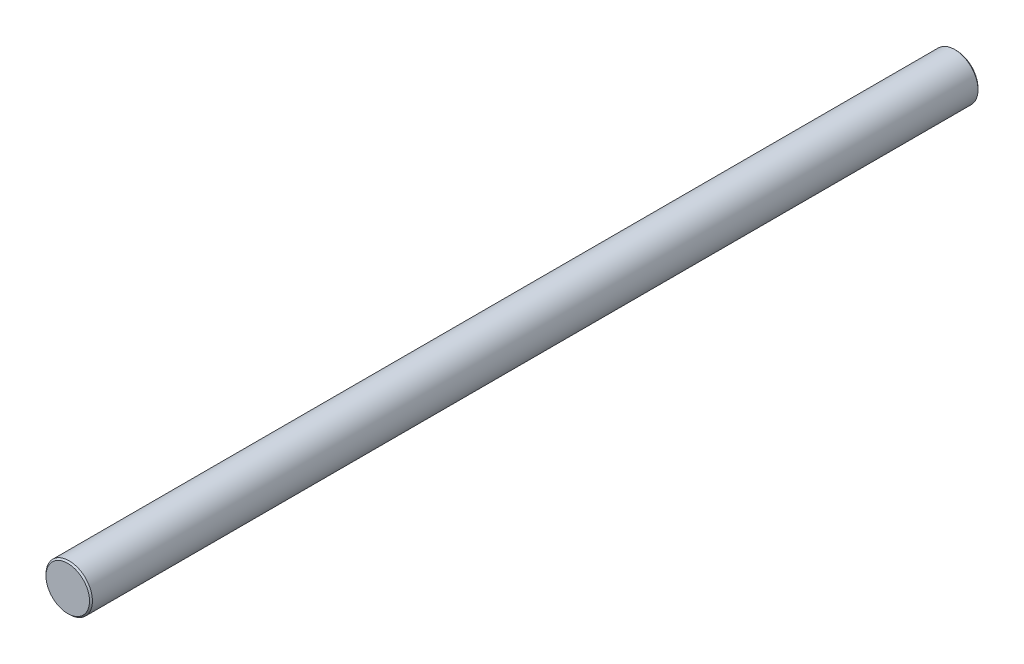
ISO-10303-21;
HEADER;
FILE_DESCRIPTION(('STEP AP214'),'2;1');
FILE_NAME('part.step','',(''),(''),'','','');
FILE_SCHEMA(('AUTOMOTIVE_DESIGN { 1 0 10303 214 1 1 1 1 }'));
ENDSEC;
DATA;
#1=APPLICATION_CONTEXT('core data for automotive mechanical design processes');
#2=APPLICATION_PROTOCOL_DEFINITION('international standard','automotive_design',2000,#1);
#3=PRODUCT_CONTEXT('',#1,'mechanical');
#4=PRODUCT('Part','Part','',(#3));
#5=PRODUCT_RELATED_PRODUCT_CATEGORY('part','',(#4));
#6=PRODUCT_DEFINITION_FORMATION('','',#4);
#7=PRODUCT_DEFINITION_CONTEXT('part definition',#1,'design');
#8=PRODUCT_DEFINITION('design','',#6,#7);
#9=PRODUCT_DEFINITION_SHAPE('','',#8);
#10=(LENGTH_UNIT() NAMED_UNIT(*) SI_UNIT(.MILLI.,.METRE.));
#11=(NAMED_UNIT(*) PLANE_ANGLE_UNIT() SI_UNIT($,.RADIAN.));
#12=(NAMED_UNIT(*) SI_UNIT($,.STERADIAN.) SOLID_ANGLE_UNIT());
#13=UNCERTAINTY_MEASURE_WITH_UNIT(LENGTH_MEASURE(1.E-05),#10,'distance_accuracy_value','');
#14=(GEOMETRIC_REPRESENTATION_CONTEXT(3) GLOBAL_UNCERTAINTY_ASSIGNED_CONTEXT((#13)) GLOBAL_UNIT_ASSIGNED_CONTEXT((#10,
#11,#12)) REPRESENTATION_CONTEXT('',''));
#15=CARTESIAN_POINT('',(0.,0.,0.));
#16=DIRECTION('',(0.,0.,1.));
#17=DIRECTION('',(1.,0.,0.));
#18=AXIS2_PLACEMENT_3D('',#15,#16,#17);
#19=CARTESIAN_POINT('',(0.,0.,306.));
#20=DIRECTION('',(0.,0.,-1.));
#21=DIRECTION('',(-1.,0.,0.));
#22=AXIS2_PLACEMENT_3D('',#19,#20,#21);
#23=CYLINDRICAL_SURFACE('',#22,8.);
#24=CARTESIAN_POINT('',(0.,0.,0.5));
#25=DIRECTION('',(0.,0.,1.));
#26=DIRECTION('',(1.,0.,0.));
#27=AXIS2_PLACEMENT_3D('',#24,#25,#26);
#28=CIRCLE('',#27,8.);
#29=CARTESIAN_POINT('',(8.,0.,0.5));
#30=VERTEX_POINT('',#29);
#31=EDGE_CURVE('E47',#30,#30,#28,.T.);
#32=ORIENTED_EDGE('',*,*,#31,.T.);
#33=EDGE_LOOP('',(#32));
#34=FACE_BOUND('',#33,.T.);
#35=CARTESIAN_POINT('',(0.,0.,305.5));
#36=DIRECTION('',(0.,0.,1.));
#37=DIRECTION('',(1.,0.,0.));
#38=AXIS2_PLACEMENT_3D('',#35,#36,#37);
#39=CIRCLE('',#38,8.);
#40=CARTESIAN_POINT('',(8.,0.,305.5));
#41=VERTEX_POINT('',#40);
#42=EDGE_CURVE('E51',#41,#41,#39,.F.);
#43=ORIENTED_EDGE('',*,*,#42,.T.);
#44=EDGE_LOOP('',(#43));
#45=FACE_BOUND('',#44,.T.);
#46=ADVANCED_FACE('F35',(#34,#45),#23,.T.);
#47=CARTESIAN_POINT('',(0.,0.,306.));
#48=DIRECTION('',(0.,0.,1.));
#49=DIRECTION('',(1.,0.,0.));
#50=AXIS2_PLACEMENT_3D('',#47,#48,#49);
#51=PLANE('',#50);
#52=CARTESIAN_POINT('',(0.,0.,306.));
#53=DIRECTION('',(0.,0.,1.));
#54=DIRECTION('',(1.,0.,0.));
#55=AXIS2_PLACEMENT_3D('',#52,#53,#54);
#56=CIRCLE('',#55,7.49999999999998);
#57=CARTESIAN_POINT('',(7.49999999999998,0.,306.));
#58=VERTEX_POINT('',#57);
#59=EDGE_CURVE('E10',#58,#58,#56,.T.);
#60=ORIENTED_EDGE('',*,*,#59,.T.);
#61=EDGE_LOOP('',(#60));
#62=FACE_BOUND('',#61,.T.);
#63=ADVANCED_FACE('F67',(#62),#51,.T.);
#64=CARTESIAN_POINT('',(0.,0.,0.));
#65=DIRECTION('',(0.,0.,1.));
#66=DIRECTION('',(1.,0.,0.));
#67=AXIS2_PLACEMENT_3D('',#64,#65,#66);
#68=PLANE('',#67);
#69=CARTESIAN_POINT('',(0.,0.,0.));
#70=DIRECTION('',(0.,0.,1.));
#71=DIRECTION('',(1.,0.,0.));
#72=AXIS2_PLACEMENT_3D('',#69,#70,#71);
#73=CIRCLE('',#72,7.50000000000001);
#74=CARTESIAN_POINT('',(7.50000000000001,0.,0.));
#75=VERTEX_POINT('',#74);
#76=EDGE_CURVE('E43',#75,#75,#73,.F.);
#77=ORIENTED_EDGE('',*,*,#76,.T.);
#78=EDGE_LOOP('',(#77));
#79=FACE_BOUND('',#78,.T.);
#80=ADVANCED_FACE('F64',(#79),#68,.F.);
#81=CARTESIAN_POINT('',(0.,0.,0.5));
#82=DIRECTION('',(0.,0.,1.));
#83=DIRECTION('',(1.,0.,0.));
#84=AXIS2_PLACEMENT_3D('',#81,#82,#83);
#85=CONICAL_SURFACE('',#84,8.,0.785398163397441);
#86=ORIENTED_EDGE('',*,*,#76,.F.);
#87=EDGE_LOOP('',(#86));
#88=FACE_BOUND('',#87,.T.);
#89=ORIENTED_EDGE('',*,*,#31,.F.);
#90=EDGE_LOOP('',(#89));
#91=FACE_BOUND('',#90,.T.);
#92=ADVANCED_FACE('F60',(#88,#91),#85,.T.);
#93=CARTESIAN_POINT('',(0.,0.,306.));
#94=DIRECTION('',(0.,0.,-1.));
#95=DIRECTION('',(-1.,0.,0.));
#96=AXIS2_PLACEMENT_3D('',#93,#94,#95);
#97=CONICAL_SURFACE('',#96,7.49999999999998,0.785398163397525);
#98=ORIENTED_EDGE('',*,*,#42,.F.);
#99=EDGE_LOOP('',(#98));
#100=FACE_BOUND('',#99,.T.);
#101=ORIENTED_EDGE('',*,*,#59,.F.);
#102=EDGE_LOOP('',(#101));
#103=FACE_BOUND('',#102,.T.);
#104=ADVANCED_FACE('F38',(#100,#103),#97,.T.);
#105=CLOSED_SHELL('',(#46,#63,#80,#92,#104));
#106=MANIFOLD_SOLID_BREP('B2',#105);
#107=ADVANCED_BREP_SHAPE_REPRESENTATION('',(#18,#106),#14);
#108=SHAPE_DEFINITION_REPRESENTATION(#9,#107);
ENDSEC;
END-ISO-10303-21;
